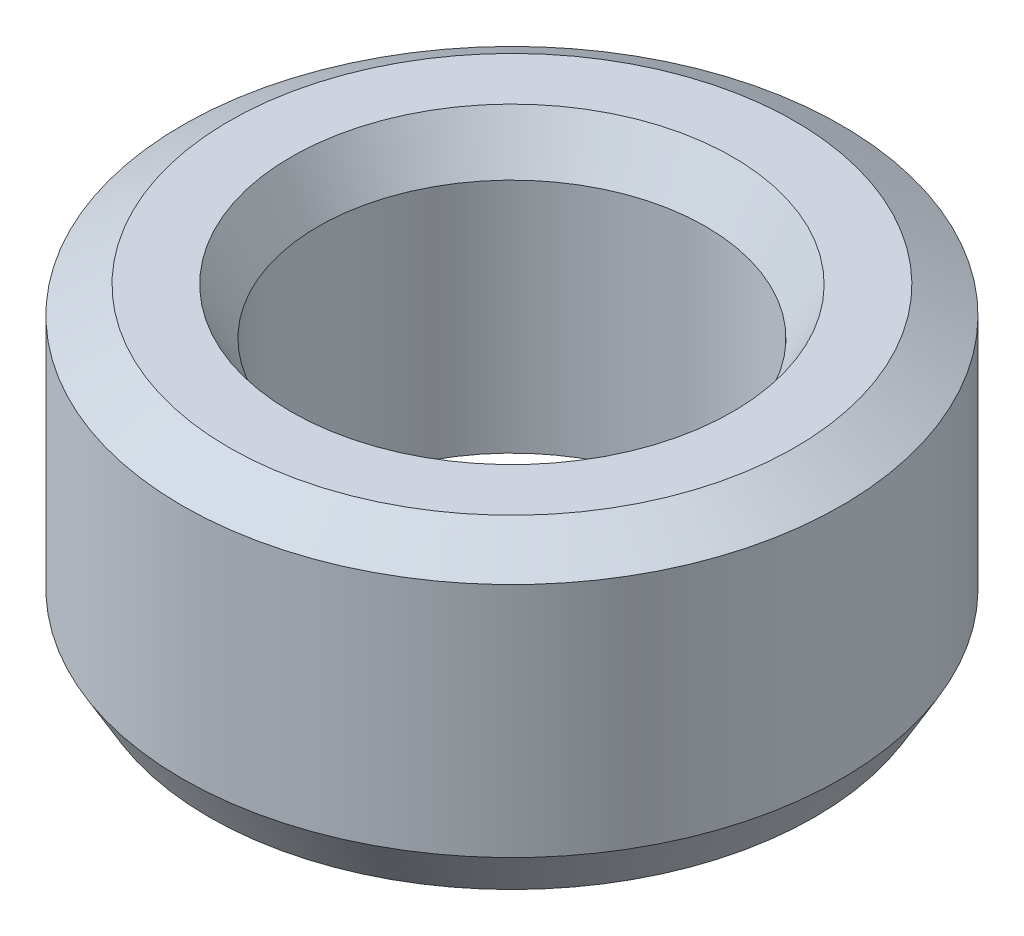
ISO-10303-21;
HEADER;
FILE_DESCRIPTION(('STEP AP214'),'2;1');
FILE_NAME('part.step','',(''),(''),'','','');
FILE_SCHEMA(('AUTOMOTIVE_DESIGN { 1 0 10303 214 1 1 1 1 }'));
ENDSEC;
DATA;
#1=APPLICATION_CONTEXT('core data for automotive mechanical design processes');
#2=APPLICATION_PROTOCOL_DEFINITION('international standard','automotive_design',2000,#1);
#3=PRODUCT_CONTEXT('',#1,'mechanical');
#4=PRODUCT('Part','Part','',(#3));
#5=PRODUCT_RELATED_PRODUCT_CATEGORY('part','',(#4));
#6=PRODUCT_DEFINITION_FORMATION('','',#4);
#7=PRODUCT_DEFINITION_CONTEXT('part definition',#1,'design');
#8=PRODUCT_DEFINITION('design','',#6,#7);
#9=PRODUCT_DEFINITION_SHAPE('','',#8);
#10=(LENGTH_UNIT() NAMED_UNIT(*) SI_UNIT(.MILLI.,.METRE.));
#11=(NAMED_UNIT(*) PLANE_ANGLE_UNIT() SI_UNIT($,.RADIAN.));
#12=(NAMED_UNIT(*) SI_UNIT($,.STERADIAN.) SOLID_ANGLE_UNIT());
#13=UNCERTAINTY_MEASURE_WITH_UNIT(LENGTH_MEASURE(1.E-05),#10,'distance_accuracy_value','');
#14=(GEOMETRIC_REPRESENTATION_CONTEXT(3) GLOBAL_UNCERTAINTY_ASSIGNED_CONTEXT((#13)) GLOBAL_UNIT_ASSIGNED_CONTEXT((#10,
#11,#12)) REPRESENTATION_CONTEXT('',''));
#15=CARTESIAN_POINT('',(0.,0.,0.));
#16=DIRECTION('',(0.,0.,1.));
#17=DIRECTION('',(1.,0.,0.));
#18=AXIS2_PLACEMENT_3D('',#15,#16,#17);
#19=CARTESIAN_POINT('',(0.,35.2938676452961,0.));
#20=DIRECTION('',(0.,-1.,0.));
#21=DIRECTION('',(0.,0.,-1.));
#22=AXIS2_PLACEMENT_3D('',#19,#20,#21);
#23=CYLINDRICAL_SURFACE('',#22,37.5);
#24=CARTESIAN_POINT('',(0.,5.31964921717773,0.));
#25=DIRECTION('',(0.,1.,0.));
#26=DIRECTION('',(0.,0.,1.));
#27=AXIS2_PLACEMENT_3D('',#24,#25,#26);
#28=CIRCLE('',#27,37.5);
#29=CARTESIAN_POINT('',(0.,5.31964921717773,37.5));
#30=VERTEX_POINT('',#29);
#31=EDGE_CURVE('E10',#30,#30,#28,.T.);
#32=ORIENTED_EDGE('',*,*,#31,.T.);
#33=EDGE_LOOP('',(#32));
#34=FACE_BOUND('',#33,.T.);
#35=CARTESIAN_POINT('',(0.,32.2225667377642,0.));
#36=DIRECTION('',(0.,1.,0.));
#37=DIRECTION('',(0.,0.,1.));
#38=AXIS2_PLACEMENT_3D('',#35,#36,#37);
#39=CIRCLE('',#38,37.5);
#40=CARTESIAN_POINT('',(0.,32.2225667377642,37.5));
#41=VERTEX_POINT('',#40);
#42=EDGE_CURVE('E50',#41,#41,#39,.F.);
#43=ORIENTED_EDGE('',*,*,#42,.T.);
#44=EDGE_LOOP('',(#43));
#45=FACE_BOUND('',#44,.T.);
#46=ADVANCED_FACE('F39',(#34,#45),#23,.T.);
#47=CARTESIAN_POINT('',(0.,35.2938676452961,0.));
#48=DIRECTION('',(0.,1.,0.));
#49=DIRECTION('',(0.,0.,1.));
#50=AXIS2_PLACEMENT_3D('',#47,#48,#49);
#51=PLANE('',#50);
#52=CARTESIAN_POINT('',(0.,35.2938676452961,0.));
#53=DIRECTION('',(0.,1.,0.));
#54=DIRECTION('',(0.,0.,1.));
#55=AXIS2_PLACEMENT_3D('',#52,#53,#54);
#56=CIRCLE('',#55,25.1216150918186);
#57=CARTESIAN_POINT('',(0.,35.2938676452961,25.1216150918186));
#58=VERTEX_POINT('',#57);
#59=EDGE_CURVE('E58',#58,#58,#56,.F.);
#60=ORIENTED_EDGE('',*,*,#59,.T.);
#61=EDGE_LOOP('',(#60));
#62=FACE_BOUND('',#61,.T.);
#63=CARTESIAN_POINT('',(0.,35.2938676452961,0.));
#64=DIRECTION('',(0.,1.,0.));
#65=DIRECTION('',(0.,0.,1.));
#66=AXIS2_PLACEMENT_3D('',#63,#64,#65);
#67=CIRCLE('',#66,32.1803507828223);
#68=CARTESIAN_POINT('',(0.,35.2938676452961,32.1803507828223));
#69=VERTEX_POINT('',#68);
#70=EDGE_CURVE('E61',#69,#69,#67,.T.);
#71=ORIENTED_EDGE('',*,*,#70,.T.);
#72=EDGE_LOOP('',(#71));
#73=FACE_BOUND('',#72,.T.);
#74=ADVANCED_FACE('F88',(#62,#73),#51,.T.);
#75=CARTESIAN_POINT('',(0.,0.,0.));
#76=DIRECTION('',(0.,1.,0.));
#77=DIRECTION('',(0.,0.,1.));
#78=AXIS2_PLACEMENT_3D('',#75,#76,#77);
#79=PLANE('',#78);
#80=CARTESIAN_POINT('',(0.,0.,0.));
#81=DIRECTION('',(0.,1.,0.));
#82=DIRECTION('',(0.,0.,1.));
#83=AXIS2_PLACEMENT_3D('',#80,#81,#82);
#84=CIRCLE('',#83,27.3699634014643);
#85=CARTESIAN_POINT('',(0.,0.,27.3699634014643));
#86=VERTEX_POINT('',#85);
#87=EDGE_CURVE('E51',#86,#86,#84,.T.);
#88=ORIENTED_EDGE('',*,*,#87,.T.);
#89=EDGE_LOOP('',(#88));
#90=FACE_BOUND('',#89,.T.);
#91=CARTESIAN_POINT('',(0.,0.,0.));
#92=DIRECTION('',(0.,1.,0.));
#93=DIRECTION('',(0.,0.,1.));
#94=AXIS2_PLACEMENT_3D('',#91,#92,#93);
#95=CIRCLE('',#94,34.428699092468);
#96=CARTESIAN_POINT('',(0.,0.,34.428699092468));
#97=VERTEX_POINT('',#96);
#98=EDGE_CURVE('E54',#97,#97,#95,.F.);
#99=ORIENTED_EDGE('',*,*,#98,.T.);
#100=EDGE_LOOP('',(#99));
#101=FACE_BOUND('',#100,.T.);
#102=ADVANCED_FACE('F83',(#90,#101),#79,.F.);
#103=CARTESIAN_POINT('',(0.,35.2938676452961,0.));
#104=DIRECTION('',(0.,-1.,0.));
#105=DIRECTION('',(0.,0.,-1.));
#106=AXIS2_PLACEMENT_3D('',#103,#104,#105);
#107=CYLINDRICAL_SURFACE('',#106,22.0503141842866);
#108=CARTESIAN_POINT('',(0.,29.9742184281184,0.));
#109=DIRECTION('',(0.,1.,0.));
#110=DIRECTION('',(0.,0.,1.));
#111=AXIS2_PLACEMENT_3D('',#108,#109,#110);
#112=CIRCLE('',#111,22.0503141842866);
#113=CARTESIAN_POINT('',(0.,29.9742184281184,22.0503141842866));
#114=VERTEX_POINT('',#113);
#115=EDGE_CURVE('E67',#114,#114,#112,.T.);
#116=ORIENTED_EDGE('',*,*,#115,.T.);
#117=EDGE_LOOP('',(#116));
#118=FACE_BOUND('',#117,.T.);
#119=CARTESIAN_POINT('',(0.,3.07130090753194,0.));
#120=DIRECTION('',(0.,1.,0.));
#121=DIRECTION('',(0.,0.,1.));
#122=AXIS2_PLACEMENT_3D('',#119,#120,#121);
#123=CIRCLE('',#122,22.0503141842866);
#124=CARTESIAN_POINT('',(0.,3.07130090753194,22.0503141842866));
#125=VERTEX_POINT('',#124);
#126=EDGE_CURVE('E69',#125,#125,#123,.F.);
#127=ORIENTED_EDGE('',*,*,#126,.T.);
#128=EDGE_LOOP('',(#127));
#129=FACE_BOUND('',#128,.T.);
#130=ADVANCED_FACE('F71',(#118,#129),#107,.F.);
#131=CARTESIAN_POINT('',(0.,29.9742184281184,0.));
#132=DIRECTION('',(0.,1.,0.));
#133=DIRECTION('',(0.,0.,1.));
#134=AXIS2_PLACEMENT_3D('',#131,#132,#133);
#135=CONICAL_SURFACE('',#134,22.0503141842866,0.523598775598304);
#136=ORIENTED_EDGE('',*,*,#59,.F.);
#137=EDGE_LOOP('',(#136));
#138=FACE_BOUND('',#137,.T.);
#139=ORIENTED_EDGE('',*,*,#115,.F.);
#140=EDGE_LOOP('',(#139));
#141=FACE_BOUND('',#140,.T.);
#142=ADVANCED_FACE('F77',(#138,#141),#135,.F.);
#143=CARTESIAN_POINT('',(0.,0.,0.));
#144=DIRECTION('',(0.,-1.,0.));
#145=DIRECTION('',(0.,0.,-1.));
#146=AXIS2_PLACEMENT_3D('',#143,#144,#145);
#147=CONICAL_SURFACE('',#146,27.3699634014643,1.04719755119659);
#148=ORIENTED_EDGE('',*,*,#126,.F.);
#149=EDGE_LOOP('',(#148));
#150=FACE_BOUND('',#149,.T.);
#151=ORIENTED_EDGE('',*,*,#87,.F.);
#152=EDGE_LOOP('',(#151));
#153=FACE_BOUND('',#152,.T.);
#154=ADVANCED_FACE('F73',(#150,#153),#147,.F.);
#155=CARTESIAN_POINT('',(0.,5.31964921717773,0.));
#156=DIRECTION('',(0.,1.,0.));
#157=DIRECTION('',(0.,0.,1.));
#158=AXIS2_PLACEMENT_3D('',#155,#156,#157);
#159=CONICAL_SURFACE('',#158,37.5,0.523598775598303);
#160=ORIENTED_EDGE('',*,*,#98,.F.);
#161=EDGE_LOOP('',(#160));
#162=FACE_BOUND('',#161,.T.);
#163=ORIENTED_EDGE('',*,*,#31,.F.);
#164=EDGE_LOOP('',(#163));
#165=FACE_BOUND('',#164,.T.);
#166=ADVANCED_FACE('F76',(#162,#165),#159,.T.);
#167=CARTESIAN_POINT('',(0.,35.2938676452961,0.));
#168=DIRECTION('',(0.,-1.,0.));
#169=DIRECTION('',(0.,0.,-1.));
#170=AXIS2_PLACEMENT_3D('',#167,#168,#169);
#171=CONICAL_SURFACE('',#170,32.1803507828223,1.04719755119659);
#172=ORIENTED_EDGE('',*,*,#42,.F.);
#173=EDGE_LOOP('',(#172));
#174=FACE_BOUND('',#173,.T.);
#175=ORIENTED_EDGE('',*,*,#70,.F.);
#176=EDGE_LOOP('',(#175));
#177=FACE_BOUND('',#176,.T.);
#178=ADVANCED_FACE('F45',(#174,#177),#171,.T.);
#179=CLOSED_SHELL('',(#46,#74,#102,#130,#142,#154,#166,#178));
#180=MANIFOLD_SOLID_BREP('B2',#179);
#181=ADVANCED_BREP_SHAPE_REPRESENTATION('',(#18,#180),#14);
#182=SHAPE_DEFINITION_REPRESENTATION(#9,#181);
ENDSEC;
END-ISO-10303-21;
